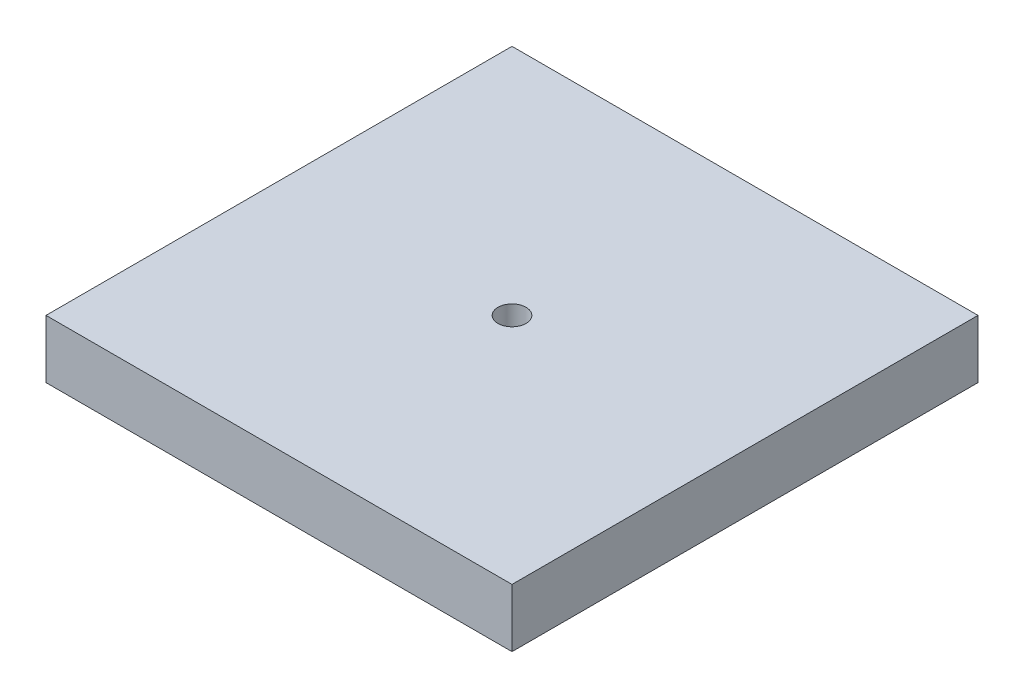
ISO-10303-21;
HEADER;
FILE_DESCRIPTION(('STEP AP214'),'2;1');
FILE_NAME('part.step','',(''),(''),'','','');
FILE_SCHEMA(('AUTOMOTIVE_DESIGN { 1 0 10303 214 1 1 1 1 }'));
ENDSEC;
DATA;
#1=APPLICATION_CONTEXT('core data for automotive mechanical design processes');
#2=APPLICATION_PROTOCOL_DEFINITION('international standard','automotive_design',2000,#1);
#3=PRODUCT_CONTEXT('',#1,'mechanical');
#4=PRODUCT('Part','Part','',(#3));
#5=PRODUCT_RELATED_PRODUCT_CATEGORY('part','',(#4));
#6=PRODUCT_DEFINITION_FORMATION('','',#4);
#7=PRODUCT_DEFINITION_CONTEXT('part definition',#1,'design');
#8=PRODUCT_DEFINITION('design','',#6,#7);
#9=PRODUCT_DEFINITION_SHAPE('','',#8);
#10=(LENGTH_UNIT() NAMED_UNIT(*) SI_UNIT(.MILLI.,.METRE.));
#11=(NAMED_UNIT(*) PLANE_ANGLE_UNIT() SI_UNIT($,.RADIAN.));
#12=(NAMED_UNIT(*) SI_UNIT($,.STERADIAN.) SOLID_ANGLE_UNIT());
#13=UNCERTAINTY_MEASURE_WITH_UNIT(LENGTH_MEASURE(1.E-05),#10,'distance_accuracy_value','');
#14=(GEOMETRIC_REPRESENTATION_CONTEXT(3) GLOBAL_UNCERTAINTY_ASSIGNED_CONTEXT((#13)) GLOBAL_UNIT_ASSIGNED_CONTEXT((#10,
#11,#12)) REPRESENTATION_CONTEXT('',''));
#15=CARTESIAN_POINT('',(0.,0.,0.));
#16=DIRECTION('',(0.,0.,1.));
#17=DIRECTION('',(1.,0.,0.));
#18=AXIS2_PLACEMENT_3D('',#15,#16,#17);
#19=CARTESIAN_POINT('',(0.,5.,0.));
#20=DIRECTION('',(0.,-1.,0.));
#21=DIRECTION('',(0.,0.,-1.));
#22=AXIS2_PLACEMENT_3D('',#19,#20,#21);
#23=PLANE('',#22);
#24=DIRECTION('',(0.,0.,-1.));
#25=VECTOR('',#24,1.);
#26=CARTESIAN_POINT('',(20.,5.,20.));
#27=LINE('',#26,#25);
#28=CARTESIAN_POINT('',(20.,5.,20.));
#29=VERTEX_POINT('',#28);
#30=CARTESIAN_POINT('',(20.,5.,-20.));
#31=VERTEX_POINT('',#30);
#32=EDGE_CURVE('E85',#29,#31,#27,.T.);
#33=ORIENTED_EDGE('',*,*,#32,.T.);
#34=DIRECTION('',(-1.,0.,0.));
#35=VECTOR('',#34,1.);
#36=CARTESIAN_POINT('',(-20.,5.,-20.));
#37=LINE('',#36,#35);
#38=CARTESIAN_POINT('',(-20.,5.,-20.));
#39=VERTEX_POINT('',#38);
#40=EDGE_CURVE('E80',#31,#39,#37,.T.);
#41=ORIENTED_EDGE('',*,*,#40,.T.);
#42=DIRECTION('',(0.,0.,1.));
#43=VECTOR('',#42,1.);
#44=CARTESIAN_POINT('',(-20.,5.,20.));
#45=LINE('',#44,#43);
#46=CARTESIAN_POINT('',(-20.,5.,20.));
#47=VERTEX_POINT('',#46);
#48=EDGE_CURVE('E83',#39,#47,#45,.T.);
#49=ORIENTED_EDGE('',*,*,#48,.T.);
#50=DIRECTION('',(1.,0.,0.));
#51=VECTOR('',#50,1.);
#52=CARTESIAN_POINT('',(-20.,5.,20.));
#53=LINE('',#52,#51);
#54=EDGE_CURVE('E50',#47,#29,#53,.T.);
#55=ORIENTED_EDGE('',*,*,#54,.T.);
#56=EDGE_LOOP('',(#33,#41,#49,#55));
#57=FACE_BOUND('',#56,.T.);
#58=CARTESIAN_POINT('',(0.,5.,0.));
#59=DIRECTION('',(0.,1.,0.));
#60=DIRECTION('',(0.,0.,1.));
#61=AXIS2_PLACEMENT_3D('',#58,#59,#60);
#62=CIRCLE('',#61,1.205);
#63=CARTESIAN_POINT('',(0.,5.,1.205));
#64=VERTEX_POINT('',#63);
#65=EDGE_CURVE('E100',#64,#64,#62,.T.);
#66=ORIENTED_EDGE('',*,*,#65,.F.);
#67=EDGE_LOOP('',(#66));
#68=FACE_BOUND('',#67,.T.);
#69=ADVANCED_FACE('F33',(#57,#68),#23,.F.);
#70=CARTESIAN_POINT('',(0.,0.,0.));
#71=DIRECTION('',(0.,-1.,0.));
#72=DIRECTION('',(0.,0.,-1.));
#73=AXIS2_PLACEMENT_3D('',#70,#71,#72);
#74=PLANE('',#73);
#75=DIRECTION('',(0.,0.,-1.));
#76=VECTOR('',#75,1.);
#77=CARTESIAN_POINT('',(20.,0.,20.));
#78=LINE('',#77,#76);
#79=CARTESIAN_POINT('',(20.,0.,20.));
#80=VERTEX_POINT('',#79);
#81=CARTESIAN_POINT('',(20.,0.,-20.));
#82=VERTEX_POINT('',#81);
#83=EDGE_CURVE('E97',#80,#82,#78,.T.);
#84=ORIENTED_EDGE('',*,*,#83,.F.);
#85=DIRECTION('',(1.,0.,0.));
#86=VECTOR('',#85,1.);
#87=CARTESIAN_POINT('',(-20.,0.,20.));
#88=LINE('',#87,#86);
#89=CARTESIAN_POINT('',(-20.,0.,20.));
#90=VERTEX_POINT('',#89);
#91=EDGE_CURVE('E73',#90,#80,#88,.T.);
#92=ORIENTED_EDGE('',*,*,#91,.F.);
#93=DIRECTION('',(0.,0.,1.));
#94=VECTOR('',#93,1.);
#95=CARTESIAN_POINT('',(-20.,0.,20.));
#96=LINE('',#95,#94);
#97=CARTESIAN_POINT('',(-20.,0.,-20.));
#98=VERTEX_POINT('',#97);
#99=EDGE_CURVE('E67',#98,#90,#96,.T.);
#100=ORIENTED_EDGE('',*,*,#99,.F.);
#101=DIRECTION('',(-1.,0.,0.));
#102=VECTOR('',#101,1.);
#103=CARTESIAN_POINT('',(-20.,0.,-20.));
#104=LINE('',#103,#102);
#105=EDGE_CURVE('E89',#82,#98,#104,.T.);
#106=ORIENTED_EDGE('',*,*,#105,.F.);
#107=EDGE_LOOP('',(#84,#92,#100,#106));
#108=FACE_BOUND('',#107,.T.);
#109=CARTESIAN_POINT('',(0.,0.,0.));
#110=DIRECTION('',(0.,1.,0.));
#111=DIRECTION('',(0.,0.,1.));
#112=AXIS2_PLACEMENT_3D('',#109,#110,#111);
#113=CIRCLE('',#112,1.205);
#114=CARTESIAN_POINT('',(0.,0.,1.205));
#115=VERTEX_POINT('',#114);
#116=EDGE_CURVE('E112',#115,#115,#113,.T.);
#117=ORIENTED_EDGE('',*,*,#116,.T.);
#118=EDGE_LOOP('',(#117));
#119=FACE_BOUND('',#118,.T.);
#120=ADVANCED_FACE('F108',(#108,#119),#74,.T.);
#121=CARTESIAN_POINT('',(20.,5.,20.));
#122=DIRECTION('',(-1.,0.,0.));
#123=DIRECTION('',(0.,0.,1.));
#124=AXIS2_PLACEMENT_3D('',#121,#122,#123);
#125=PLANE('',#124);
#126=ORIENTED_EDGE('',*,*,#83,.T.);
#127=DIRECTION('',(0.,-1.,0.));
#128=VECTOR('',#127,1.);
#129=CARTESIAN_POINT('',(20.,5.,-20.));
#130=LINE('',#129,#128);
#131=EDGE_CURVE('E11',#31,#82,#130,.T.);
#132=ORIENTED_EDGE('',*,*,#131,.F.);
#133=ORIENTED_EDGE('',*,*,#32,.F.);
#134=DIRECTION('',(0.,-1.,0.));
#135=VECTOR('',#134,1.);
#136=CARTESIAN_POINT('',(20.,5.,20.));
#137=LINE('',#136,#135);
#138=EDGE_CURVE('E93',#29,#80,#137,.T.);
#139=ORIENTED_EDGE('',*,*,#138,.T.);
#140=EDGE_LOOP('',(#126,#132,#133,#139));
#141=FACE_BOUND('',#140,.T.);
#142=ADVANCED_FACE('F35',(#141),#125,.F.);
#143=CARTESIAN_POINT('',(-20.,5.,-20.));
#144=DIRECTION('',(0.,0.,1.));
#145=DIRECTION('',(1.,0.,0.));
#146=AXIS2_PLACEMENT_3D('',#143,#144,#145);
#147=PLANE('',#146);
#148=ORIENTED_EDGE('',*,*,#105,.T.);
#149=DIRECTION('',(0.,-1.,0.));
#150=VECTOR('',#149,1.);
#151=CARTESIAN_POINT('',(-20.,5.,-20.));
#152=LINE('',#151,#150);
#153=EDGE_CURVE('E42',#39,#98,#152,.T.);
#154=ORIENTED_EDGE('',*,*,#153,.F.);
#155=ORIENTED_EDGE('',*,*,#40,.F.);
#156=ORIENTED_EDGE('',*,*,#131,.T.);
#157=EDGE_LOOP('',(#148,#154,#155,#156));
#158=FACE_BOUND('',#157,.T.);
#159=ADVANCED_FACE('F88',(#158),#147,.F.);
#160=CARTESIAN_POINT('',(-20.,5.,20.));
#161=DIRECTION('',(1.,0.,0.));
#162=DIRECTION('',(0.,0.,-1.));
#163=AXIS2_PLACEMENT_3D('',#160,#161,#162);
#164=PLANE('',#163);
#165=ORIENTED_EDGE('',*,*,#99,.T.);
#166=DIRECTION('',(0.,-1.,0.));
#167=VECTOR('',#166,1.);
#168=CARTESIAN_POINT('',(-20.,5.,20.));
#169=LINE('',#168,#167);
#170=EDGE_CURVE('E90',#47,#90,#169,.T.);
#171=ORIENTED_EDGE('',*,*,#170,.F.);
#172=ORIENTED_EDGE('',*,*,#48,.F.);
#173=ORIENTED_EDGE('',*,*,#153,.T.);
#174=EDGE_LOOP('',(#165,#171,#172,#173));
#175=FACE_BOUND('',#174,.T.);
#176=ADVANCED_FACE('F91',(#175),#164,.F.);
#177=CARTESIAN_POINT('',(-20.,5.,20.));
#178=DIRECTION('',(0.,0.,-1.));
#179=DIRECTION('',(-1.,0.,0.));
#180=AXIS2_PLACEMENT_3D('',#177,#178,#179);
#181=PLANE('',#180);
#182=ORIENTED_EDGE('',*,*,#91,.T.);
#183=ORIENTED_EDGE('',*,*,#138,.F.);
#184=ORIENTED_EDGE('',*,*,#54,.F.);
#185=ORIENTED_EDGE('',*,*,#170,.T.);
#186=EDGE_LOOP('',(#182,#183,#184,#185));
#187=FACE_BOUND('',#186,.T.);
#188=ADVANCED_FACE('F105',(#187),#181,.F.);
#189=CARTESIAN_POINT('',(0.,5.,0.));
#190=DIRECTION('',(0.,-1.,0.));
#191=DIRECTION('',(0.,0.,-1.));
#192=AXIS2_PLACEMENT_3D('',#189,#190,#191);
#193=CYLINDRICAL_SURFACE('',#192,1.205);
#194=ORIENTED_EDGE('',*,*,#65,.T.);
#195=EDGE_LOOP('',(#194));
#196=FACE_BOUND('',#195,.T.);
#197=ORIENTED_EDGE('',*,*,#116,.F.);
#198=EDGE_LOOP('',(#197));
#199=FACE_BOUND('',#198,.T.);
#200=ADVANCED_FACE('F118',(#196,#199),#193,.F.);
#201=CLOSED_SHELL('',(#69,#120,#142,#159,#176,#188,#200));
#202=MANIFOLD_SOLID_BREP('B2',#201);
#203=ADVANCED_BREP_SHAPE_REPRESENTATION('',(#18,#202),#14);
#204=SHAPE_DEFINITION_REPRESENTATION(#9,#203);
ENDSEC;
END-ISO-10303-21;
